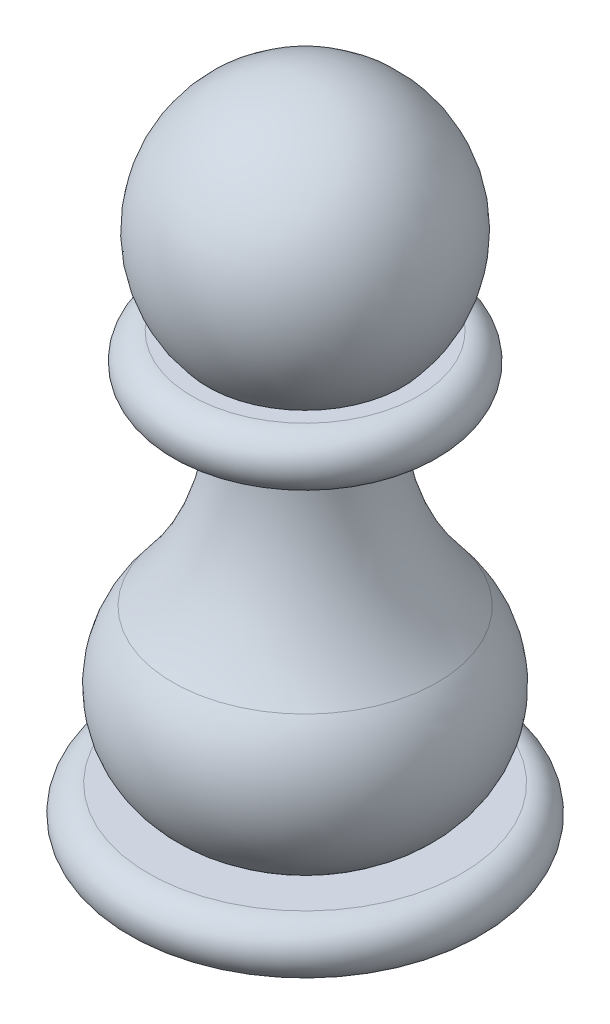
ISO-10303-21;
HEADER;
FILE_DESCRIPTION(('STEP AP214'),'2;1');
FILE_NAME('part.step','',(''),(''),'','','');
FILE_SCHEMA(('AUTOMOTIVE_DESIGN { 1 0 10303 214 1 1 1 1 }'));
ENDSEC;
DATA;
#1=APPLICATION_CONTEXT('core data for automotive mechanical design processes');
#2=APPLICATION_PROTOCOL_DEFINITION('international standard','automotive_design',2000,#1);
#3=PRODUCT_CONTEXT('',#1,'mechanical');
#4=PRODUCT('Part','Part','',(#3));
#5=PRODUCT_RELATED_PRODUCT_CATEGORY('part','',(#4));
#6=PRODUCT_DEFINITION_FORMATION('','',#4);
#7=PRODUCT_DEFINITION_CONTEXT('part definition',#1,'design');
#8=PRODUCT_DEFINITION('design','',#6,#7);
#9=PRODUCT_DEFINITION_SHAPE('','',#8);
#10=(LENGTH_UNIT() NAMED_UNIT(*) SI_UNIT(.MILLI.,.METRE.));
#11=(NAMED_UNIT(*) PLANE_ANGLE_UNIT() SI_UNIT($,.RADIAN.));
#12=(NAMED_UNIT(*) SI_UNIT($,.STERADIAN.) SOLID_ANGLE_UNIT());
#13=UNCERTAINTY_MEASURE_WITH_UNIT(LENGTH_MEASURE(1.E-05),#10,'distance_accuracy_value','');
#14=(GEOMETRIC_REPRESENTATION_CONTEXT(3) GLOBAL_UNCERTAINTY_ASSIGNED_CONTEXT((#13)) GLOBAL_UNIT_ASSIGNED_CONTEXT((#10,
#11,#12)) REPRESENTATION_CONTEXT('',''));
#15=CARTESIAN_POINT('',(0.,0.,0.));
#16=DIRECTION('',(0.,0.,1.));
#17=DIRECTION('',(1.,0.,0.));
#18=AXIS2_PLACEMENT_3D('',#15,#16,#17);
#19=CARTESIAN_POINT('',(0.,-10.,0.));
#20=DIRECTION('',(0.,-1.,0.));
#21=DIRECTION('',(0.,0.,-1.));
#22=AXIS2_PLACEMENT_3D('',#19,#20,#21);
#23=PLANE('',#22);
#24=CARTESIAN_POINT('',(0.,-10.,0.));
#25=DIRECTION('',(0.,-1.,0.));
#26=DIRECTION('',(0.,0.,-1.));
#27=AXIS2_PLACEMENT_3D('',#24,#25,#26);
#28=CIRCLE('',#27,9.);
#29=CARTESIAN_POINT('',(0.,-10.,-9.));
#30=VERTEX_POINT('',#29);
#31=EDGE_CURVE('E10',#30,#30,#28,.T.);
#32=ORIENTED_EDGE('',*,*,#31,.T.);
#33=EDGE_LOOP('',(#32));
#34=FACE_BOUND('',#33,.T.);
#35=ADVANCED_FACE('F35',(#34),#23,.T.);
#36=CARTESIAN_POINT('',(0.,-8.5,0.));
#37=DIRECTION('',(0.,-1.,0.));
#38=DIRECTION('',(0.,0.,-1.));
#39=AXIS2_PLACEMENT_3D('',#36,#37,#38);
#40=TOROIDAL_SURFACE('',#39,9.,1.5);
#41=CARTESIAN_POINT('',(0.,-7.,0.));
#42=DIRECTION('',(0.,-1.,0.));
#43=DIRECTION('',(0.,0.,-1.));
#44=AXIS2_PLACEMENT_3D('',#41,#42,#43);
#45=CIRCLE('',#44,9.);
#46=CARTESIAN_POINT('',(0.,-7.,-9.));
#47=VERTEX_POINT('',#46);
#48=EDGE_CURVE('E41',#47,#47,#45,.T.);
#49=ORIENTED_EDGE('',*,*,#48,.T.);
#50=EDGE_LOOP('',(#49));
#51=FACE_BOUND('',#50,.T.);
#52=ORIENTED_EDGE('',*,*,#31,.F.);
#53=EDGE_LOOP('',(#52));
#54=FACE_BOUND('',#53,.T.);
#55=ADVANCED_FACE('F82',(#51,#54),#40,.T.);
#56=CARTESIAN_POINT('',(0.,-7.,0.));
#57=DIRECTION('',(0.,1.,0.));
#58=DIRECTION('',(0.,0.,1.));
#59=AXIS2_PLACEMENT_3D('',#56,#57,#58);
#60=PLANE('',#59);
#61=CARTESIAN_POINT('',(0.,-7.,0.));
#62=DIRECTION('',(0.,-1.,0.));
#63=DIRECTION('',(0.,0.,-1.));
#64=AXIS2_PLACEMENT_3D('',#61,#62,#63);
#65=CIRCLE('',#64,6.5);
#66=CARTESIAN_POINT('',(0.,-7.,-6.5));
#67=VERTEX_POINT('',#66);
#68=EDGE_CURVE('E45',#67,#67,#65,.T.);
#69=ORIENTED_EDGE('',*,*,#68,.T.);
#70=EDGE_LOOP('',(#69));
#71=FACE_BOUND('',#70,.T.);
#72=ORIENTED_EDGE('',*,*,#48,.F.);
#73=EDGE_LOOP('',(#72));
#74=FACE_BOUND('',#73,.T.);
#75=ADVANCED_FACE('F86',(#71,#74),#60,.T.);
#76=CARTESIAN_POINT('',(0.,-2.09344168783479,0.));
#77=DIRECTION('',(0.,-1.,0.));
#78=DIRECTION('',(0.,0.,-1.));
#79=AXIS2_PLACEMENT_3D('',#76,#77,#78);
#80=DEGENERATE_TOROIDAL_SURFACE('',#79,3.04664141315698,6.,.T.);
#81=ORIENTED_EDGE('',*,*,#68,.F.);
#82=EDGE_LOOP('',(#81));
#83=FACE_BOUND('',#82,.T.);
#84=CARTESIAN_POINT('',(0.,1.80831458651876,0.));
#85=DIRECTION('',(0.,-1.,0.));
#86=DIRECTION('',(0.,0.,-1.));
#87=AXIS2_PLACEMENT_3D('',#84,#85,#86);
#88=CIRCLE('',#87,7.6047438665407);
#89=CARTESIAN_POINT('',(0.,1.80831458651876,-7.6047438665407));
#90=VERTEX_POINT('',#89);
#91=EDGE_CURVE('E49',#90,#90,#88,.T.);
#92=ORIENTED_EDGE('',*,*,#91,.T.);
#93=EDGE_LOOP('',(#92));
#94=FACE_BOUND('',#93,.T.);
#95=ADVANCED_FACE('F90',(#83,#94),#80,.T.);
#96=CARTESIAN_POINT('',(0.,11.5627052724026,0.));
#97=DIRECTION('',(0.,-1.,0.));
#98=DIRECTION('',(0.,0.,-1.));
#99=AXIS2_PLACEMENT_3D('',#96,#97,#98);
#100=TOROIDAL_SURFACE('',#99,19.,15.);
#101=ORIENTED_EDGE('',*,*,#91,.F.);
#102=EDGE_LOOP('',(#101));
#103=FACE_BOUND('',#102,.T.);
#104=CARTESIAN_POINT('',(0.,11.5627052724026,0.));
#105=DIRECTION('',(0.,-1.,0.));
#106=DIRECTION('',(0.,0.,-1.));
#107=AXIS2_PLACEMENT_3D('',#104,#105,#106);
#108=CIRCLE('',#107,4.);
#109=CARTESIAN_POINT('',(0.,11.5627052724026,-4.));
#110=VERTEX_POINT('',#109);
#111=EDGE_CURVE('E54',#110,#110,#108,.T.);
#112=ORIENTED_EDGE('',*,*,#111,.T.);
#113=EDGE_LOOP('',(#112));
#114=FACE_BOUND('',#113,.T.);
#115=ADVANCED_FACE('F97',(#103,#114),#100,.F.);
#116=CARTESIAN_POINT('',(0.,0.,0.));
#117=DIRECTION('',(0.,-1.,0.));
#118=DIRECTION('',(0.,0.,-1.));
#119=AXIS2_PLACEMENT_3D('',#116,#117,#118);
#120=CYLINDRICAL_SURFACE('',#119,4.);
#121=ORIENTED_EDGE('',*,*,#111,.F.);
#122=EDGE_LOOP('',(#121));
#123=FACE_BOUND('',#122,.T.);
#124=CARTESIAN_POINT('',(0.,12.5,0.));
#125=DIRECTION('',(0.,-1.,0.));
#126=DIRECTION('',(0.,0.,-1.));
#127=AXIS2_PLACEMENT_3D('',#124,#125,#126);
#128=CIRCLE('',#127,4.);
#129=CARTESIAN_POINT('',(0.,12.5,-4.));
#130=VERTEX_POINT('',#129);
#131=EDGE_CURVE('E57',#130,#130,#128,.T.);
#132=ORIENTED_EDGE('',*,*,#131,.T.);
#133=EDGE_LOOP('',(#132));
#134=FACE_BOUND('',#133,.T.);
#135=ADVANCED_FACE('F101',(#123,#134),#120,.T.);
#136=CARTESIAN_POINT('',(0.,12.5,0.));
#137=DIRECTION('',(0.,1.,0.));
#138=DIRECTION('',(0.,0.,1.));
#139=AXIS2_PLACEMENT_3D('',#136,#137,#138);
#140=PLANE('',#139);
#141=ORIENTED_EDGE('',*,*,#131,.F.);
#142=EDGE_LOOP('',(#141));
#143=FACE_BOUND('',#142,.T.);
#144=CARTESIAN_POINT('',(0.,12.5,0.));
#145=DIRECTION('',(0.,-1.,0.));
#146=DIRECTION('',(0.,0.,-1.));
#147=AXIS2_PLACEMENT_3D('',#144,#145,#146);
#148=CIRCLE('',#147,6.5);
#149=CARTESIAN_POINT('',(0.,12.5,-6.5));
#150=VERTEX_POINT('',#149);
#151=EDGE_CURVE('E60',#150,#150,#148,.T.);
#152=ORIENTED_EDGE('',*,*,#151,.T.);
#153=EDGE_LOOP('',(#152));
#154=FACE_BOUND('',#153,.T.);
#155=ADVANCED_FACE('F105',(#143,#154),#140,.F.);
#156=CARTESIAN_POINT('',(0.,14.,0.));
#157=DIRECTION('',(0.,-1.,0.));
#158=DIRECTION('',(0.,0.,-1.));
#159=AXIS2_PLACEMENT_3D('',#156,#157,#158);
#160=TOROIDAL_SURFACE('',#159,6.5,1.5);
#161=ORIENTED_EDGE('',*,*,#151,.F.);
#162=EDGE_LOOP('',(#161));
#163=FACE_BOUND('',#162,.T.);
#164=CARTESIAN_POINT('',(0.,15.5,0.));
#165=DIRECTION('',(0.,-1.,0.));
#166=DIRECTION('',(0.,0.,-1.));
#167=AXIS2_PLACEMENT_3D('',#164,#165,#166);
#168=CIRCLE('',#167,6.5);
#169=CARTESIAN_POINT('',(0.,15.5,-6.5));
#170=VERTEX_POINT('',#169);
#171=EDGE_CURVE('E63',#170,#170,#168,.T.);
#172=ORIENTED_EDGE('',*,*,#171,.T.);
#173=EDGE_LOOP('',(#172));
#174=FACE_BOUND('',#173,.T.);
#175=ADVANCED_FACE('F78',(#163,#174),#160,.T.);
#176=CARTESIAN_POINT('',(0.,15.5,0.));
#177=DIRECTION('',(0.,-1.,0.));
#178=DIRECTION('',(0.,0.,-1.));
#179=AXIS2_PLACEMENT_3D('',#176,#177,#178);
#180=PLANE('',#179);
#181=ORIENTED_EDGE('',*,*,#171,.F.);
#182=EDGE_LOOP('',(#181));
#183=FACE_BOUND('',#182,.T.);
#184=CARTESIAN_POINT('',(0.,15.5,0.));
#185=DIRECTION('',(0.,-1.,0.));
#186=DIRECTION('',(0.,0.,-1.));
#187=AXIS2_PLACEMENT_3D('',#184,#185,#186);
#188=CIRCLE('',#187,5.59016994374947);
#189=CARTESIAN_POINT('',(0.,15.5,-5.59016994374947));
#190=VERTEX_POINT('',#189);
#191=EDGE_CURVE('E66',#190,#190,#188,.T.);
#192=ORIENTED_EDGE('',*,*,#191,.T.);
#193=EDGE_LOOP('',(#192));
#194=FACE_BOUND('',#193,.T.);
#195=ADVANCED_FACE('F70',(#183,#194),#180,.F.);
#196=CARTESIAN_POINT('',(0.,20.5,0.));
#197=DIRECTION('',(0.,-1.,0.));
#198=DIRECTION('',(-1.,0.,0.));
#199=AXIS2_PLACEMENT_3D('',#196,#197,#198);
#200=SPHERICAL_SURFACE('',#199,7.5);
#201=ORIENTED_EDGE('',*,*,#191,.F.);
#202=EDGE_LOOP('',(#201));
#203=FACE_BOUND('',#202,.T.);
#204=ADVANCED_FACE('F72',(#203),#200,.T.);
#205=CLOSED_SHELL('',(#35,#55,#75,#95,#115,#135,#155,#175,#195,#204));
#206=MANIFOLD_SOLID_BREP('B2',#205);
#207=ADVANCED_BREP_SHAPE_REPRESENTATION('',(#18,#206),#14);
#208=SHAPE_DEFINITION_REPRESENTATION(#9,#207);
ENDSEC;
END-ISO-10303-21;
